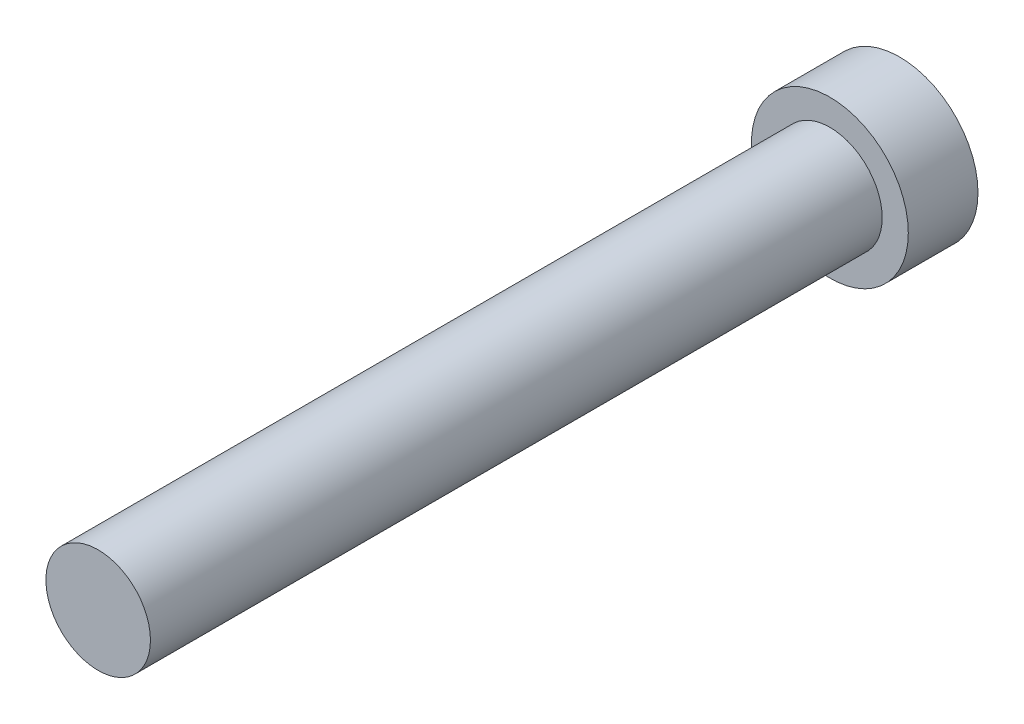
ISO-10303-21;
HEADER;
FILE_DESCRIPTION(('STEP AP214'),'2;1');
FILE_NAME('part.step','',(''),(''),'','','');
FILE_SCHEMA(('AUTOMOTIVE_DESIGN { 1 0 10303 214 1 1 1 1 }'));
ENDSEC;
DATA;
#1=APPLICATION_CONTEXT('core data for automotive mechanical design processes');
#2=APPLICATION_PROTOCOL_DEFINITION('international standard','automotive_design',2000,#1);
#3=PRODUCT_CONTEXT('',#1,'mechanical');
#4=PRODUCT('Part','Part','',(#3));
#5=PRODUCT_RELATED_PRODUCT_CATEGORY('part','',(#4));
#6=PRODUCT_DEFINITION_FORMATION('','',#4);
#7=PRODUCT_DEFINITION_CONTEXT('part definition',#1,'design');
#8=PRODUCT_DEFINITION('design','',#6,#7);
#9=PRODUCT_DEFINITION_SHAPE('','',#8);
#10=(LENGTH_UNIT() NAMED_UNIT(*) SI_UNIT(.MILLI.,.METRE.));
#11=(NAMED_UNIT(*) PLANE_ANGLE_UNIT() SI_UNIT($,.RADIAN.));
#12=(NAMED_UNIT(*) SI_UNIT($,.STERADIAN.) SOLID_ANGLE_UNIT());
#13=UNCERTAINTY_MEASURE_WITH_UNIT(LENGTH_MEASURE(1.E-05),#10,'distance_accuracy_value','');
#14=(GEOMETRIC_REPRESENTATION_CONTEXT(3) GLOBAL_UNCERTAINTY_ASSIGNED_CONTEXT((#13)) GLOBAL_UNIT_ASSIGNED_CONTEXT((#10,
#11,#12)) REPRESENTATION_CONTEXT('',''));
#15=CARTESIAN_POINT('',(0.,0.,0.));
#16=DIRECTION('',(0.,0.,1.));
#17=DIRECTION('',(1.,0.,0.));
#18=AXIS2_PLACEMENT_3D('',#15,#16,#17);
#19=CARTESIAN_POINT('',(-36.5588854369574,15.1419264309786,20.));
#20=DIRECTION('',(0.,0.,-1.));
#21=DIRECTION('',(-1.,0.,0.));
#22=AXIS2_PLACEMENT_3D('',#19,#20,#21);
#23=CYLINDRICAL_SURFACE('',#22,22.5);
#24=CARTESIAN_POINT('',(-36.5588854369574,15.1419264309786,20.));
#25=DIRECTION('',(0.,0.,1.));
#26=DIRECTION('',(1.,0.,0.));
#27=AXIS2_PLACEMENT_3D('',#24,#25,#26);
#28=CIRCLE('',#27,22.5);
#29=CARTESIAN_POINT('',(-14.0588854369574,15.1419264309786,20.));
#30=VERTEX_POINT('',#29);
#31=EDGE_CURVE('E39',#30,#30,#28,.T.);
#32=ORIENTED_EDGE('',*,*,#31,.F.);
#33=EDGE_LOOP('',(#32));
#34=FACE_BOUND('',#33,.T.);
#35=CARTESIAN_POINT('',(-36.5588854369574,15.1419264309786,0.));
#36=DIRECTION('',(0.,0.,1.));
#37=DIRECTION('',(1.,0.,0.));
#38=AXIS2_PLACEMENT_3D('',#35,#36,#37);
#39=CIRCLE('',#38,22.5);
#40=CARTESIAN_POINT('',(-14.0588854369574,15.1419264309786,0.));
#41=VERTEX_POINT('',#40);
#42=EDGE_CURVE('E35',#41,#41,#39,.T.);
#43=ORIENTED_EDGE('',*,*,#42,.T.);
#44=EDGE_LOOP('',(#43));
#45=FACE_BOUND('',#44,.T.);
#46=ADVANCED_FACE('F32',(#34,#45),#23,.T.);
#47=CARTESIAN_POINT('',(-36.5588854369574,15.1419264309786,20.));
#48=DIRECTION('',(0.,0.,1.));
#49=DIRECTION('',(1.,0.,0.));
#50=AXIS2_PLACEMENT_3D('',#47,#48,#49);
#51=PLANE('',#50);
#52=CARTESIAN_POINT('',(-36.5588854369574,15.1419264309786,20.));
#53=DIRECTION('',(0.,0.,1.));
#54=DIRECTION('',(1.,0.,0.));
#55=AXIS2_PLACEMENT_3D('',#52,#53,#54);
#56=CIRCLE('',#55,15.);
#57=CARTESIAN_POINT('',(-21.5588854369574,15.1419264309786,20.));
#58=VERTEX_POINT('',#57);
#59=EDGE_CURVE('E10',#58,#58,#56,.T.);
#60=ORIENTED_EDGE('',*,*,#59,.F.);
#61=EDGE_LOOP('',(#60));
#62=FACE_BOUND('',#61,.T.);
#63=ORIENTED_EDGE('',*,*,#31,.T.);
#64=EDGE_LOOP('',(#63));
#65=FACE_BOUND('',#64,.T.);
#66=ADVANCED_FACE('F56',(#62,#65),#51,.T.);
#67=CARTESIAN_POINT('',(-36.5588854369574,15.1419264309786,0.));
#68=DIRECTION('',(0.,0.,1.));
#69=DIRECTION('',(1.,0.,0.));
#70=AXIS2_PLACEMENT_3D('',#67,#68,#69);
#71=PLANE('',#70);
#72=ORIENTED_EDGE('',*,*,#42,.F.);
#73=EDGE_LOOP('',(#72));
#74=FACE_BOUND('',#73,.T.);
#75=ADVANCED_FACE('F53',(#74),#71,.F.);
#76=CARTESIAN_POINT('',(-36.5588854369574,15.1419264309786,230.));
#77=DIRECTION('',(0.,0.,-1.));
#78=DIRECTION('',(-1.,0.,0.));
#79=AXIS2_PLACEMENT_3D('',#76,#77,#78);
#80=CYLINDRICAL_SURFACE('',#79,15.);
#81=CARTESIAN_POINT('',(-36.5588854369574,15.1419264309786,230.));
#82=DIRECTION('',(0.,0.,1.));
#83=DIRECTION('',(1.,0.,0.));
#84=AXIS2_PLACEMENT_3D('',#81,#82,#83);
#85=CIRCLE('',#84,15.);
#86=CARTESIAN_POINT('',(-21.5588854369574,15.1419264309786,230.));
#87=VERTEX_POINT('',#86);
#88=EDGE_CURVE('E45',#87,#87,#85,.T.);
#89=ORIENTED_EDGE('',*,*,#88,.F.);
#90=EDGE_LOOP('',(#89));
#91=FACE_BOUND('',#90,.T.);
#92=ORIENTED_EDGE('',*,*,#59,.T.);
#93=EDGE_LOOP('',(#92));
#94=FACE_BOUND('',#93,.T.);
#95=ADVANCED_FACE('F55',(#91,#94),#80,.T.);
#96=CARTESIAN_POINT('',(-36.5588854369574,15.1419264309786,230.));
#97=DIRECTION('',(0.,0.,1.));
#98=DIRECTION('',(1.,0.,0.));
#99=AXIS2_PLACEMENT_3D('',#96,#97,#98);
#100=PLANE('',#99);
#101=ORIENTED_EDGE('',*,*,#88,.T.);
#102=EDGE_LOOP('',(#101));
#103=FACE_BOUND('',#102,.T.);
#104=ADVANCED_FACE('F61',(#103),#100,.T.);
#105=CLOSED_SHELL('',(#46,#66,#75,#95,#104));
#106=MANIFOLD_SOLID_BREP('B2',#105);
#107=ADVANCED_BREP_SHAPE_REPRESENTATION('',(#18,#106),#14);
#108=SHAPE_DEFINITION_REPRESENTATION(#9,#107);
ENDSEC;
END-ISO-10303-21;
